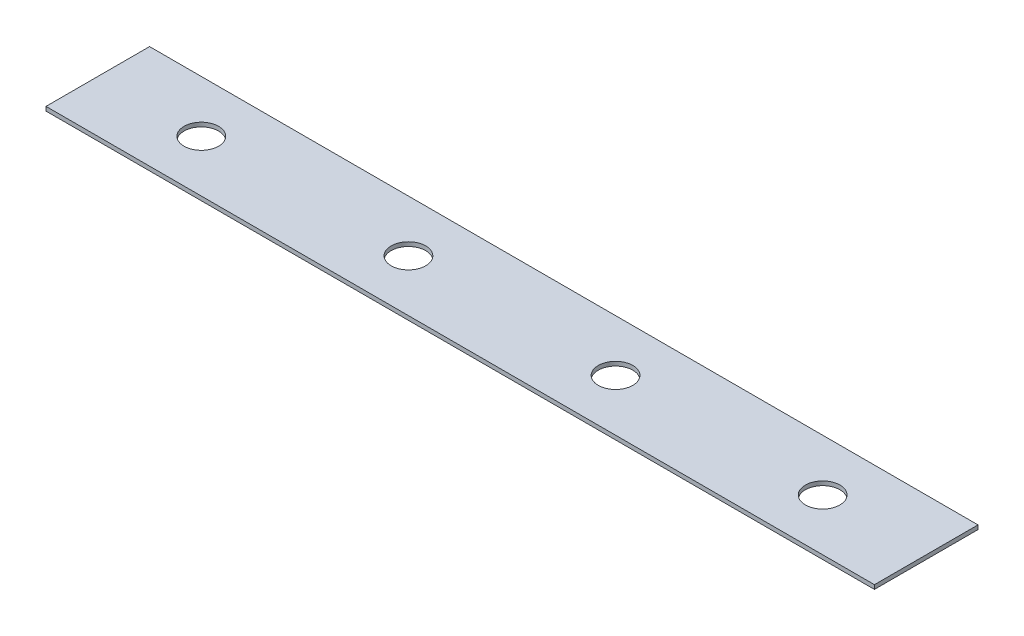
ISO-10303-21;
HEADER;
FILE_DESCRIPTION(('STEP AP214'),'2;1');
FILE_NAME('part.step','',(''),(''),'','','');
FILE_SCHEMA(('AUTOMOTIVE_DESIGN { 1 0 10303 214 1 1 1 1 }'));
ENDSEC;
DATA;
#1=APPLICATION_CONTEXT('core data for automotive mechanical design processes');
#2=APPLICATION_PROTOCOL_DEFINITION('international standard','automotive_design',2000,#1);
#3=PRODUCT_CONTEXT('',#1,'mechanical');
#4=PRODUCT('Part','Part','',(#3));
#5=PRODUCT_RELATED_PRODUCT_CATEGORY('part','',(#4));
#6=PRODUCT_DEFINITION_FORMATION('','',#4);
#7=PRODUCT_DEFINITION_CONTEXT('part definition',#1,'design');
#8=PRODUCT_DEFINITION('design','',#6,#7);
#9=PRODUCT_DEFINITION_SHAPE('','',#8);
#10=(LENGTH_UNIT() NAMED_UNIT(*) SI_UNIT(.MILLI.,.METRE.));
#11=(NAMED_UNIT(*) PLANE_ANGLE_UNIT() SI_UNIT($,.RADIAN.));
#12=(NAMED_UNIT(*) SI_UNIT($,.STERADIAN.) SOLID_ANGLE_UNIT());
#13=UNCERTAINTY_MEASURE_WITH_UNIT(LENGTH_MEASURE(1.E-05),#10,'distance_accuracy_value','');
#14=(GEOMETRIC_REPRESENTATION_CONTEXT(3) GLOBAL_UNCERTAINTY_ASSIGNED_CONTEXT((#13)) GLOBAL_UNIT_ASSIGNED_CONTEXT((#10,
#11,#12)) REPRESENTATION_CONTEXT('',''));
#15=CARTESIAN_POINT('',(0.,0.,0.));
#16=DIRECTION('',(0.,0.,1.));
#17=DIRECTION('',(1.,0.,0.));
#18=AXIS2_PLACEMENT_3D('',#15,#16,#17);
#19=CARTESIAN_POINT('',(304.8,0.,0.));
#20=DIRECTION('',(0.,0.,-1.));
#21=DIRECTION('',(0.,1.,0.));
#22=AXIS2_PLACEMENT_3D('',#19,#20,#21);
#23=PLANE('',#22);
#24=DIRECTION('',(0.,-1.,0.));
#25=VECTOR('',#24,1.);
#26=CARTESIAN_POINT('',(0.,0.,0.));
#27=LINE('',#26,#25);
#28=CARTESIAN_POINT('',(0.,1.51892,0.));
#29=VERTEX_POINT('',#28);
#30=CARTESIAN_POINT('',(0.,0.,0.));
#31=VERTEX_POINT('',#30);
#32=EDGE_CURVE('E97',#29,#31,#27,.T.);
#33=ORIENTED_EDGE('',*,*,#32,.T.);
#34=DIRECTION('',(-1.,0.,0.));
#35=VECTOR('',#34,1.);
#36=CARTESIAN_POINT('',(304.8,0.,0.));
#37=LINE('',#36,#35);
#38=CARTESIAN_POINT('',(304.8,0.,0.));
#39=VERTEX_POINT('',#38);
#40=EDGE_CURVE('E11',#39,#31,#37,.T.);
#41=ORIENTED_EDGE('',*,*,#40,.F.);
#42=DIRECTION('',(0.,-1.,0.));
#43=VECTOR('',#42,1.);
#44=CARTESIAN_POINT('',(304.8,0.,0.));
#45=LINE('',#44,#43);
#46=CARTESIAN_POINT('',(304.8,1.51892,0.));
#47=VERTEX_POINT('',#46);
#48=EDGE_CURVE('E85',#47,#39,#45,.T.);
#49=ORIENTED_EDGE('',*,*,#48,.F.);
#50=DIRECTION('',(-1.,0.,0.));
#51=VECTOR('',#50,1.);
#52=CARTESIAN_POINT('',(304.8,1.51892,0.));
#53=LINE('',#52,#51);
#54=EDGE_CURVE('E93',#47,#29,#53,.T.);
#55=ORIENTED_EDGE('',*,*,#54,.T.);
#56=EDGE_LOOP('',(#33,#41,#49,#55));
#57=FACE_BOUND('',#56,.T.);
#58=ADVANCED_FACE('F34',(#57),#23,.F.);
#59=CARTESIAN_POINT('',(304.8,0.,0.));
#60=DIRECTION('',(0.,1.,0.));
#61=DIRECTION('',(0.,0.,1.));
#62=AXIS2_PLACEMENT_3D('',#59,#60,#61);
#63=PLANE('',#62);
#64=CARTESIAN_POINT('',(38.1,0.,-19.05));
#65=DIRECTION('',(0.,1.,0.));
#66=DIRECTION('',(0.,0.,1.));
#67=AXIS2_PLACEMENT_3D('',#64,#65,#66);
#68=CIRCLE('',#67,6.35);
#69=CARTESIAN_POINT('',(38.1,0.,-12.7));
#70=VERTEX_POINT('',#69);
#71=EDGE_CURVE('E100',#70,#70,#68,.T.);
#72=ORIENTED_EDGE('',*,*,#71,.T.);
#73=EDGE_LOOP('',(#72));
#74=FACE_BOUND('',#73,.T.);
#75=CARTESIAN_POINT('',(114.3,0.,-19.05));
#76=DIRECTION('',(0.,1.,0.));
#77=DIRECTION('',(0.,0.,1.));
#78=AXIS2_PLACEMENT_3D('',#75,#76,#77);
#79=CIRCLE('',#78,6.35);
#80=CARTESIAN_POINT('',(114.3,0.,-12.7));
#81=VERTEX_POINT('',#80);
#82=EDGE_CURVE('E126',#81,#81,#79,.T.);
#83=ORIENTED_EDGE('',*,*,#82,.T.);
#84=EDGE_LOOP('',(#83));
#85=FACE_BOUND('',#84,.T.);
#86=CARTESIAN_POINT('',(190.5,0.,-19.05));
#87=DIRECTION('',(0.,1.,0.));
#88=DIRECTION('',(0.,0.,1.));
#89=AXIS2_PLACEMENT_3D('',#86,#87,#88);
#90=CIRCLE('',#89,6.35);
#91=CARTESIAN_POINT('',(190.5,0.,-12.7));
#92=VERTEX_POINT('',#91);
#93=EDGE_CURVE('E120',#92,#92,#90,.T.);
#94=ORIENTED_EDGE('',*,*,#93,.T.);
#95=EDGE_LOOP('',(#94));
#96=FACE_BOUND('',#95,.T.);
#97=CARTESIAN_POINT('',(266.7,0.,-19.05));
#98=DIRECTION('',(0.,1.,0.));
#99=DIRECTION('',(0.,0.,1.));
#100=AXIS2_PLACEMENT_3D('',#97,#98,#99);
#101=CIRCLE('',#100,6.35);
#102=CARTESIAN_POINT('',(266.7,0.,-12.7));
#103=VERTEX_POINT('',#102);
#104=EDGE_CURVE('E114',#103,#103,#101,.T.);
#105=ORIENTED_EDGE('',*,*,#104,.T.);
#106=EDGE_LOOP('',(#105));
#107=FACE_BOUND('',#106,.T.);
#108=DIRECTION('',(0.,0.,-1.));
#109=VECTOR('',#108,1.);
#110=CARTESIAN_POINT('',(0.,0.,0.));
#111=LINE('',#110,#109);
#112=CARTESIAN_POINT('',(0.,0.,-38.1));
#113=VERTEX_POINT('',#112);
#114=EDGE_CURVE('E89',#31,#113,#111,.T.);
#115=ORIENTED_EDGE('',*,*,#114,.T.);
#116=DIRECTION('',(-1.,0.,0.));
#117=VECTOR('',#116,1.);
#118=CARTESIAN_POINT('',(304.8,0.,-38.1));
#119=LINE('',#118,#117);
#120=CARTESIAN_POINT('',(304.8,0.,-38.1));
#121=VERTEX_POINT('',#120);
#122=EDGE_CURVE('E42',#121,#113,#119,.T.);
#123=ORIENTED_EDGE('',*,*,#122,.F.);
#124=DIRECTION('',(0.,0.,-1.));
#125=VECTOR('',#124,1.);
#126=CARTESIAN_POINT('',(304.8,0.,0.));
#127=LINE('',#126,#125);
#128=EDGE_CURVE('E80',#39,#121,#127,.T.);
#129=ORIENTED_EDGE('',*,*,#128,.F.);
#130=ORIENTED_EDGE('',*,*,#40,.T.);
#131=EDGE_LOOP('',(#115,#123,#129,#130));
#132=FACE_BOUND('',#131,.T.);
#133=ADVANCED_FACE('F88',(#74,#85,#96,#107,#132),#63,.F.);
#134=CARTESIAN_POINT('',(304.8,0.,-38.1));
#135=DIRECTION('',(0.,0.,1.));
#136=DIRECTION('',(1.,0.,0.));
#137=AXIS2_PLACEMENT_3D('',#134,#135,#136);
#138=PLANE('',#137);
#139=DIRECTION('',(0.,1.,0.));
#140=VECTOR('',#139,1.);
#141=CARTESIAN_POINT('',(0.,0.,-38.1));
#142=LINE('',#141,#140);
#143=CARTESIAN_POINT('',(0.,1.51892,-38.1));
#144=VERTEX_POINT('',#143);
#145=EDGE_CURVE('E67',#113,#144,#142,.T.);
#146=ORIENTED_EDGE('',*,*,#145,.T.);
#147=DIRECTION('',(-1.,0.,0.));
#148=VECTOR('',#147,1.);
#149=CARTESIAN_POINT('',(304.8,1.51892,-38.1));
#150=LINE('',#149,#148);
#151=CARTESIAN_POINT('',(304.8,1.51892,-38.1));
#152=VERTEX_POINT('',#151);
#153=EDGE_CURVE('E90',#152,#144,#150,.T.);
#154=ORIENTED_EDGE('',*,*,#153,.F.);
#155=DIRECTION('',(0.,1.,0.));
#156=VECTOR('',#155,1.);
#157=CARTESIAN_POINT('',(304.8,0.,-38.1));
#158=LINE('',#157,#156);
#159=EDGE_CURVE('E83',#121,#152,#158,.T.);
#160=ORIENTED_EDGE('',*,*,#159,.F.);
#161=ORIENTED_EDGE('',*,*,#122,.T.);
#162=EDGE_LOOP('',(#146,#154,#160,#161));
#163=FACE_BOUND('',#162,.T.);
#164=ADVANCED_FACE('F91',(#163),#138,.F.);
#165=CARTESIAN_POINT('',(304.8,1.51892,0.));
#166=DIRECTION('',(0.,-1.,0.));
#167=DIRECTION('',(0.,0.,-1.));
#168=AXIS2_PLACEMENT_3D('',#165,#166,#167);
#169=PLANE('',#168);
#170=CARTESIAN_POINT('',(38.1,1.51892,-19.05));
#171=DIRECTION('',(0.,1.,0.));
#172=DIRECTION('',(0.,0.,1.));
#173=AXIS2_PLACEMENT_3D('',#170,#171,#172);
#174=CIRCLE('',#173,6.35);
#175=CARTESIAN_POINT('',(38.1,1.51892,-12.7));
#176=VERTEX_POINT('',#175);
#177=EDGE_CURVE('E129',#176,#176,#174,.T.);
#178=ORIENTED_EDGE('',*,*,#177,.F.);
#179=EDGE_LOOP('',(#178));
#180=FACE_BOUND('',#179,.T.);
#181=CARTESIAN_POINT('',(114.3,1.51892,-19.05));
#182=DIRECTION('',(0.,1.,0.));
#183=DIRECTION('',(0.,0.,1.));
#184=AXIS2_PLACEMENT_3D('',#181,#182,#183);
#185=CIRCLE('',#184,6.35);
#186=CARTESIAN_POINT('',(114.3,1.51892,-12.7));
#187=VERTEX_POINT('',#186);
#188=EDGE_CURVE('E123',#187,#187,#185,.T.);
#189=ORIENTED_EDGE('',*,*,#188,.F.);
#190=EDGE_LOOP('',(#189));
#191=FACE_BOUND('',#190,.T.);
#192=CARTESIAN_POINT('',(190.5,1.51892,-19.05));
#193=DIRECTION('',(0.,1.,0.));
#194=DIRECTION('',(0.,0.,1.));
#195=AXIS2_PLACEMENT_3D('',#192,#193,#194);
#196=CIRCLE('',#195,6.35);
#197=CARTESIAN_POINT('',(190.5,1.51892,-12.7));
#198=VERTEX_POINT('',#197);
#199=EDGE_CURVE('E117',#198,#198,#196,.T.);
#200=ORIENTED_EDGE('',*,*,#199,.F.);
#201=EDGE_LOOP('',(#200));
#202=FACE_BOUND('',#201,.T.);
#203=CARTESIAN_POINT('',(266.7,1.51892,-19.05));
#204=DIRECTION('',(0.,1.,0.));
#205=DIRECTION('',(0.,0.,1.));
#206=AXIS2_PLACEMENT_3D('',#203,#204,#205);
#207=CIRCLE('',#206,6.35);
#208=CARTESIAN_POINT('',(266.7,1.51892,-12.7));
#209=VERTEX_POINT('',#208);
#210=EDGE_CURVE('E111',#209,#209,#207,.T.);
#211=ORIENTED_EDGE('',*,*,#210,.F.);
#212=EDGE_LOOP('',(#211));
#213=FACE_BOUND('',#212,.T.);
#214=DIRECTION('',(0.,0.,1.));
#215=VECTOR('',#214,1.);
#216=CARTESIAN_POINT('',(0.,1.51892,0.));
#217=LINE('',#216,#215);
#218=EDGE_CURVE('E73',#144,#29,#217,.T.);
#219=ORIENTED_EDGE('',*,*,#218,.T.);
#220=ORIENTED_EDGE('',*,*,#54,.F.);
#221=DIRECTION('',(0.,0.,1.));
#222=VECTOR('',#221,1.);
#223=CARTESIAN_POINT('',(304.8,1.51892,0.));
#224=LINE('',#223,#222);
#225=EDGE_CURVE('E50',#152,#47,#224,.T.);
#226=ORIENTED_EDGE('',*,*,#225,.F.);
#227=ORIENTED_EDGE('',*,*,#153,.T.);
#228=EDGE_LOOP('',(#219,#220,#226,#227));
#229=FACE_BOUND('',#228,.T.);
#230=ADVANCED_FACE('F105',(#180,#191,#202,#213,#229),#169,.F.);
#231=CARTESIAN_POINT('',(304.8,0.,0.));
#232=DIRECTION('',(-1.,0.,0.));
#233=DIRECTION('',(0.,0.,1.));
#234=AXIS2_PLACEMENT_3D('',#231,#232,#233);
#235=PLANE('',#234);
#236=ORIENTED_EDGE('',*,*,#48,.T.);
#237=ORIENTED_EDGE('',*,*,#128,.T.);
#238=ORIENTED_EDGE('',*,*,#159,.T.);
#239=ORIENTED_EDGE('',*,*,#225,.T.);
#240=EDGE_LOOP('',(#236,#237,#238,#239));
#241=FACE_BOUND('',#240,.T.);
#242=ADVANCED_FACE('F81',(#241),#235,.F.);
#243=CARTESIAN_POINT('',(0.,0.,0.));
#244=DIRECTION('',(-1.,0.,0.));
#245=DIRECTION('',(0.,0.,1.));
#246=AXIS2_PLACEMENT_3D('',#243,#244,#245);
#247=PLANE('',#246);
#248=ORIENTED_EDGE('',*,*,#32,.F.);
#249=ORIENTED_EDGE('',*,*,#218,.F.);
#250=ORIENTED_EDGE('',*,*,#145,.F.);
#251=ORIENTED_EDGE('',*,*,#114,.F.);
#252=EDGE_LOOP('',(#248,#249,#250,#251));
#253=FACE_BOUND('',#252,.T.);
#254=ADVANCED_FACE('F108',(#253),#247,.T.);
#255=CARTESIAN_POINT('',(266.7,0.,-19.05));
#256=DIRECTION('',(0.,1.,0.));
#257=DIRECTION('',(0.,0.,1.));
#258=AXIS2_PLACEMENT_3D('',#255,#256,#257);
#259=CYLINDRICAL_SURFACE('',#258,6.35);
#260=ORIENTED_EDGE('',*,*,#104,.F.);
#261=EDGE_LOOP('',(#260));
#262=FACE_BOUND('',#261,.T.);
#263=ORIENTED_EDGE('',*,*,#210,.T.);
#264=EDGE_LOOP('',(#263));
#265=FACE_BOUND('',#264,.T.);
#266=ADVANCED_FACE('F153',(#262,#265),#259,.F.);
#267=CARTESIAN_POINT('',(190.5,0.,-19.05));
#268=DIRECTION('',(0.,1.,0.));
#269=DIRECTION('',(0.,0.,1.));
#270=AXIS2_PLACEMENT_3D('',#267,#268,#269);
#271=CYLINDRICAL_SURFACE('',#270,6.35);
#272=ORIENTED_EDGE('',*,*,#93,.F.);
#273=EDGE_LOOP('',(#272));
#274=FACE_BOUND('',#273,.T.);
#275=ORIENTED_EDGE('',*,*,#199,.T.);
#276=EDGE_LOOP('',(#275));
#277=FACE_BOUND('',#276,.T.);
#278=ADVANCED_FACE('F155',(#274,#277),#271,.F.);
#279=CARTESIAN_POINT('',(114.3,0.,-19.05));
#280=DIRECTION('',(0.,1.,0.));
#281=DIRECTION('',(0.,0.,1.));
#282=AXIS2_PLACEMENT_3D('',#279,#280,#281);
#283=CYLINDRICAL_SURFACE('',#282,6.35);
#284=ORIENTED_EDGE('',*,*,#82,.F.);
#285=EDGE_LOOP('',(#284));
#286=FACE_BOUND('',#285,.T.);
#287=ORIENTED_EDGE('',*,*,#188,.T.);
#288=EDGE_LOOP('',(#287));
#289=FACE_BOUND('',#288,.T.);
#290=ADVANCED_FACE('F140',(#286,#289),#283,.F.);
#291=CARTESIAN_POINT('',(38.1,0.,-19.05));
#292=DIRECTION('',(0.,1.,0.));
#293=DIRECTION('',(0.,0.,1.));
#294=AXIS2_PLACEMENT_3D('',#291,#292,#293);
#295=CYLINDRICAL_SURFACE('',#294,6.35);
#296=ORIENTED_EDGE('',*,*,#71,.F.);
#297=EDGE_LOOP('',(#296));
#298=FACE_BOUND('',#297,.T.);
#299=ORIENTED_EDGE('',*,*,#177,.T.);
#300=EDGE_LOOP('',(#299));
#301=FACE_BOUND('',#300,.T.);
#302=ADVANCED_FACE('F137',(#298,#301),#295,.F.);
#303=CLOSED_SHELL('',(#58,#133,#164,#230,#242,#254,#266,#278,#290,#302));
#304=MANIFOLD_SOLID_BREP('B2',#303);
#305=ADVANCED_BREP_SHAPE_REPRESENTATION('',(#18,#304),#14);
#306=SHAPE_DEFINITION_REPRESENTATION(#9,#305);
ENDSEC;
END-ISO-10303-21;
